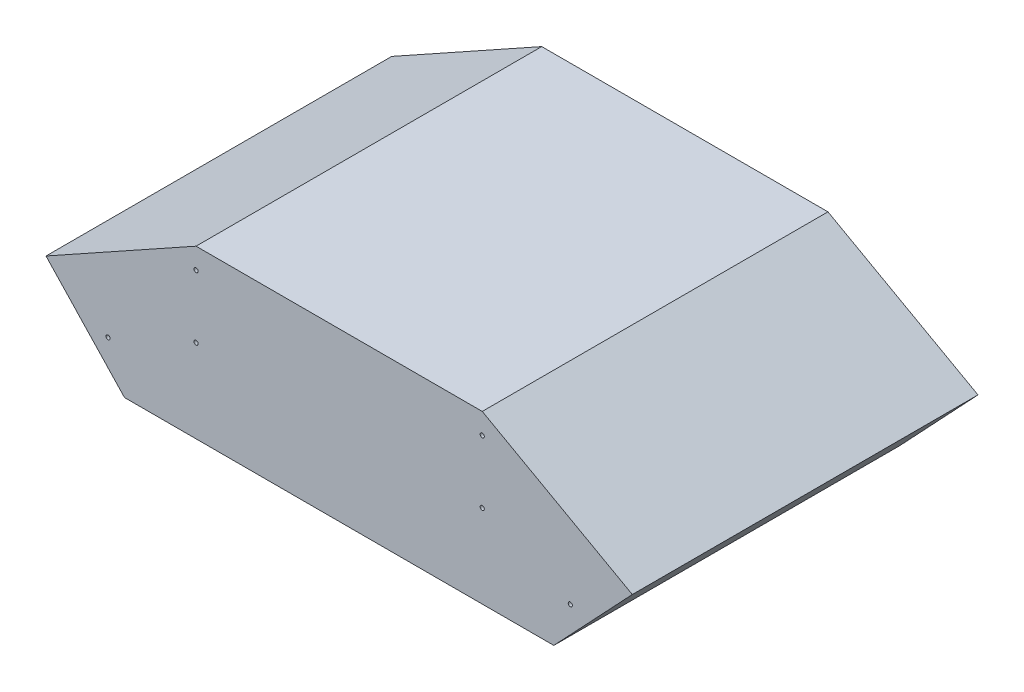
ISO-10303-21;
HEADER;
FILE_DESCRIPTION(('STEP AP214'),'2;1');
FILE_NAME('part.step','',(''),(''),'','','');
FILE_SCHEMA(('AUTOMOTIVE_DESIGN { 1 0 10303 214 1 1 1 1 }'));
ENDSEC;
DATA;
#1=APPLICATION_CONTEXT('core data for automotive mechanical design processes');
#2=APPLICATION_PROTOCOL_DEFINITION('international standard','automotive_design',2000,#1);
#3=PRODUCT_CONTEXT('',#1,'mechanical');
#4=PRODUCT('Part','Part','',(#3));
#5=PRODUCT_RELATED_PRODUCT_CATEGORY('part','',(#4));
#6=PRODUCT_DEFINITION_FORMATION('','',#4);
#7=PRODUCT_DEFINITION_CONTEXT('part definition',#1,'design');
#8=PRODUCT_DEFINITION('design','',#6,#7);
#9=PRODUCT_DEFINITION_SHAPE('','',#8);
#10=(LENGTH_UNIT() NAMED_UNIT(*) SI_UNIT(.MILLI.,.METRE.));
#11=(NAMED_UNIT(*) PLANE_ANGLE_UNIT() SI_UNIT($,.RADIAN.));
#12=(NAMED_UNIT(*) SI_UNIT($,.STERADIAN.) SOLID_ANGLE_UNIT());
#13=UNCERTAINTY_MEASURE_WITH_UNIT(LENGTH_MEASURE(1.E-05),#10,'distance_accuracy_value','');
#14=(GEOMETRIC_REPRESENTATION_CONTEXT(3) GLOBAL_UNCERTAINTY_ASSIGNED_CONTEXT((#13)) GLOBAL_UNIT_ASSIGNED_CONTEXT((#10,
#11,#12)) REPRESENTATION_CONTEXT('',''));
#15=CARTESIAN_POINT('',(0.,0.,0.));
#16=DIRECTION('',(0.,0.,1.));
#17=DIRECTION('',(1.,0.,0.));
#18=AXIS2_PLACEMENT_3D('',#15,#16,#17);
#19=CARTESIAN_POINT('',(0.,-24.1355478406086,50.));
#20=DIRECTION('',(0.,1.,0.));
#21=DIRECTION('',(0.,0.,1.));
#22=AXIS2_PLACEMENT_3D('',#19,#20,#21);
#23=PLANE('',#22);
#24=DIRECTION('',(1.,0.,0.));
#25=VECTOR('',#24,1.);
#26=CARTESIAN_POINT('',(0.,-24.1355478406086,0.));
#27=LINE('',#26,#25);
#28=CARTESIAN_POINT('',(-31.0477998896085,-24.1355478406086,0.));
#29=VERTEX_POINT('',#28);
#30=CARTESIAN_POINT('',(31.0477998896085,-24.1355478406086,0.));
#31=VERTEX_POINT('',#30);
#32=EDGE_CURVE('E141',#29,#31,#27,.T.);
#33=ORIENTED_EDGE('',*,*,#32,.T.);
#34=DIRECTION('',(0.,0.,-1.));
#35=VECTOR('',#34,1.);
#36=CARTESIAN_POINT('',(31.0477998896085,-24.1355478406086,50.));
#37=LINE('',#36,#35);
#38=CARTESIAN_POINT('',(31.0477998896085,-24.1355478406086,50.));
#39=VERTEX_POINT('',#38);
#40=EDGE_CURVE('E11',#39,#31,#37,.T.);
#41=ORIENTED_EDGE('',*,*,#40,.F.);
#42=DIRECTION('',(1.,0.,0.));
#43=VECTOR('',#42,1.);
#44=CARTESIAN_POINT('',(0.,-24.1355478406086,50.));
#45=LINE('',#44,#43);
#46=CARTESIAN_POINT('',(-31.0477998896085,-24.1355478406086,50.));
#47=VERTEX_POINT('',#46);
#48=EDGE_CURVE('E252',#47,#39,#45,.T.);
#49=ORIENTED_EDGE('',*,*,#48,.F.);
#50=DIRECTION('',(0.,0.,-1.));
#51=VECTOR('',#50,1.);
#52=CARTESIAN_POINT('',(-31.0477998896085,-24.1355478406086,50.));
#53=LINE('',#52,#51);
#54=EDGE_CURVE('E53',#47,#29,#53,.T.);
#55=ORIENTED_EDGE('',*,*,#54,.T.);
#56=EDGE_LOOP('',(#33,#41,#49,#55));
#57=FACE_BOUND('',#56,.T.);
#58=ADVANCED_FACE('F36',(#57),#23,.F.);
#59=CARTESIAN_POINT('',(28.4996329319788,-26.8411618301041,50.));
#60=DIRECTION('',(-0.727970767134698,0.68560816958181,0.));
#61=DIRECTION('',(-0.68560816958181,-0.727970767134698,0.));
#62=AXIS2_PLACEMENT_3D('',#59,#60,#61);
#63=PLANE('',#62);
#64=DIRECTION('',(0.68560816958181,0.727970767134698,0.));
#65=VECTOR('',#64,1.);
#66=CARTESIAN_POINT('',(28.4996329319788,-26.8411618301041,0.));
#67=LINE('',#66,#65);
#68=CARTESIAN_POINT('',(42.4006680908968,-12.0812046452642,0.));
#69=VERTEX_POINT('',#68);
#70=EDGE_CURVE('E143',#31,#69,#67,.T.);
#71=ORIENTED_EDGE('',*,*,#70,.T.);
#72=DIRECTION('',(0.,0.,-1.));
#73=VECTOR('',#72,1.);
#74=CARTESIAN_POINT('',(42.4006680908968,-12.0812046452642,50.));
#75=LINE('',#74,#73);
#76=CARTESIAN_POINT('',(42.4006680908968,-12.0812046452642,50.));
#77=VERTEX_POINT('',#76);
#78=EDGE_CURVE('E45',#77,#69,#75,.T.);
#79=ORIENTED_EDGE('',*,*,#78,.F.);
#80=DIRECTION('',(0.68560816958181,0.727970767134698,0.));
#81=VECTOR('',#80,1.);
#82=CARTESIAN_POINT('',(28.4996329319788,-26.8411618301041,50.));
#83=LINE('',#82,#81);
#84=EDGE_CURVE('E86',#39,#77,#83,.T.);
#85=ORIENTED_EDGE('',*,*,#84,.F.);
#86=ORIENTED_EDGE('',*,*,#40,.T.);
#87=EDGE_LOOP('',(#71,#79,#85,#86));
#88=FACE_BOUND('',#87,.T.);
#89=ADVANCED_FACE('F176',(#88),#63,.F.);
#90=CARTESIAN_POINT('',(4.8968682362258,8.79651473784486,50.));
#91=DIRECTION('',(0.486395360066549,0.873738836097911,0.));
#92=DIRECTION('',(-0.873738836097911,0.486395360066549,0.));
#93=AXIS2_PLACEMENT_3D('',#90,#91,#92);
#94=PLANE('',#93);
#95=DIRECTION('',(0.873738836097911,-0.486395360066549,0.));
#96=VECTOR('',#95,1.);
#97=CARTESIAN_POINT('',(4.8968682362258,8.79651473784486,0.));
#98=LINE('',#97,#96);
#99=CARTESIAN_POINT('',(20.698533259739,0.,0.));
#100=VERTEX_POINT('',#99);
#101=EDGE_CURVE('E146',#100,#69,#98,.T.);
#102=ORIENTED_EDGE('',*,*,#101,.F.);
#103=DIRECTION('',(0.,0.,-1.));
#104=VECTOR('',#103,1.);
#105=CARTESIAN_POINT('',(20.698533259739,0.,50.));
#106=LINE('',#105,#104);
#107=CARTESIAN_POINT('',(20.698533259739,0.,50.));
#108=VERTEX_POINT('',#107);
#109=EDGE_CURVE('E105',#108,#100,#106,.T.);
#110=ORIENTED_EDGE('',*,*,#109,.F.);
#111=DIRECTION('',(0.873738836097911,-0.486395360066549,0.));
#112=VECTOR('',#111,1.);
#113=CARTESIAN_POINT('',(4.8968682362258,8.79651473784486,50.));
#114=LINE('',#113,#112);
#115=EDGE_CURVE('E117',#108,#77,#114,.T.);
#116=ORIENTED_EDGE('',*,*,#115,.T.);
#117=ORIENTED_EDGE('',*,*,#78,.T.);
#118=EDGE_LOOP('',(#102,#110,#116,#117));
#119=FACE_BOUND('',#118,.T.);
#120=ADVANCED_FACE('F175',(#119),#94,.T.);
#121=CARTESIAN_POINT('',(0.,0.,50.));
#122=DIRECTION('',(0.,1.,0.));
#123=DIRECTION('',(0.,0.,1.));
#124=AXIS2_PLACEMENT_3D('',#121,#122,#123);
#125=PLANE('',#124);
#126=DIRECTION('',(1.,0.,0.));
#127=VECTOR('',#126,1.);
#128=CARTESIAN_POINT('',(0.,0.,0.));
#129=LINE('',#128,#127);
#130=CARTESIAN_POINT('',(-20.698533259739,0.,0.));
#131=VERTEX_POINT('',#130);
#132=EDGE_CURVE('E102',#131,#100,#129,.T.);
#133=ORIENTED_EDGE('',*,*,#132,.F.);
#134=DIRECTION('',(0.,0.,-1.));
#135=VECTOR('',#134,1.);
#136=CARTESIAN_POINT('',(-20.698533259739,0.,50.));
#137=LINE('',#136,#135);
#138=CARTESIAN_POINT('',(-20.698533259739,0.,50.));
#139=VERTEX_POINT('',#138);
#140=EDGE_CURVE('E96',#139,#131,#137,.T.);
#141=ORIENTED_EDGE('',*,*,#140,.F.);
#142=DIRECTION('',(1.,0.,0.));
#143=VECTOR('',#142,1.);
#144=CARTESIAN_POINT('',(0.,0.,50.));
#145=LINE('',#144,#143);
#146=EDGE_CURVE('E100',#139,#108,#145,.T.);
#147=ORIENTED_EDGE('',*,*,#146,.T.);
#148=ORIENTED_EDGE('',*,*,#109,.T.);
#149=EDGE_LOOP('',(#133,#141,#147,#148));
#150=FACE_BOUND('',#149,.T.);
#151=ADVANCED_FACE('F98',(#150),#125,.T.);
#152=CARTESIAN_POINT('',(-4.8968682362258,8.79651473784486,50.));
#153=DIRECTION('',(0.486395360066549,-0.873738836097911,0.));
#154=DIRECTION('',(0.873738836097911,0.486395360066549,0.));
#155=AXIS2_PLACEMENT_3D('',#152,#153,#154);
#156=PLANE('',#155);
#157=DIRECTION('',(-0.873738836097911,-0.486395360066549,0.));
#158=VECTOR('',#157,1.);
#159=CARTESIAN_POINT('',(-4.8968682362258,8.79651473784486,0.));
#160=LINE('',#159,#158);
#161=CARTESIAN_POINT('',(-42.4006680908968,-12.0812046452642,0.));
#162=VERTEX_POINT('',#161);
#163=EDGE_CURVE('E150',#131,#162,#160,.T.);
#164=ORIENTED_EDGE('',*,*,#163,.T.);
#165=DIRECTION('',(0.,0.,-1.));
#166=VECTOR('',#165,1.);
#167=CARTESIAN_POINT('',(-42.4006680908968,-12.0812046452642,50.));
#168=LINE('',#167,#166);
#169=CARTESIAN_POINT('',(-42.4006680908968,-12.0812046452642,50.));
#170=VERTEX_POINT('',#169);
#171=EDGE_CURVE('E74',#170,#162,#168,.T.);
#172=ORIENTED_EDGE('',*,*,#171,.F.);
#173=DIRECTION('',(-0.873738836097911,-0.486395360066549,0.));
#174=VECTOR('',#173,1.);
#175=CARTESIAN_POINT('',(-4.8968682362258,8.79651473784486,50.));
#176=LINE('',#175,#174);
#177=EDGE_CURVE('E107',#139,#170,#176,.T.);
#178=ORIENTED_EDGE('',*,*,#177,.F.);
#179=ORIENTED_EDGE('',*,*,#140,.T.);
#180=EDGE_LOOP('',(#164,#172,#178,#179));
#181=FACE_BOUND('',#180,.T.);
#182=ADVANCED_FACE('F108',(#181),#156,.F.);
#183=CARTESIAN_POINT('',(20.698533259739,-12.0812046452642,50.));
#184=DIRECTION('',(0.,0.,-1.));
#185=DIRECTION('',(-1.,0.,0.));
#186=AXIS2_PLACEMENT_3D('',#183,#184,#185);
#187=CYLINDRICAL_SURFACE('',#186,0.3);
#188=CARTESIAN_POINT('',(20.698533259739,-12.0812046452642,50.));
#189=DIRECTION('',(0.,0.,1.));
#190=DIRECTION('',(1.,0.,0.));
#191=AXIS2_PLACEMENT_3D('',#188,#189,#190);
#192=CIRCLE('',#191,0.3);
#193=CARTESIAN_POINT('',(20.998533259739,-12.0812046452642,50.));
#194=VERTEX_POINT('',#193);
#195=EDGE_CURVE('E132',#194,#194,#192,.F.);
#196=ORIENTED_EDGE('',*,*,#195,.F.);
#197=EDGE_LOOP('',(#196));
#198=FACE_BOUND('',#197,.T.);
#199=CARTESIAN_POINT('',(20.698533259739,-12.0812046452642,0.));
#200=DIRECTION('',(0.,0.,1.));
#201=DIRECTION('',(1.,0.,0.));
#202=AXIS2_PLACEMENT_3D('',#199,#200,#201);
#203=CIRCLE('',#202,0.3);
#204=CARTESIAN_POINT('',(20.998533259739,-12.0812046452642,0.));
#205=VERTEX_POINT('',#204);
#206=EDGE_CURVE('E164',#205,#205,#203,.F.);
#207=ORIENTED_EDGE('',*,*,#206,.T.);
#208=EDGE_LOOP('',(#207));
#209=FACE_BOUND('',#208,.T.);
#210=ADVANCED_FACE('F205',(#198,#209),#187,.F.);
#211=CARTESIAN_POINT('',(20.698533259739,-3.,50.));
#212=DIRECTION('',(0.,0.,-1.));
#213=DIRECTION('',(-1.,0.,0.));
#214=AXIS2_PLACEMENT_3D('',#211,#212,#213);
#215=CYLINDRICAL_SURFACE('',#214,0.3);
#216=CARTESIAN_POINT('',(20.698533259739,-3.,50.));
#217=DIRECTION('',(0.,0.,1.));
#218=DIRECTION('',(1.,0.,0.));
#219=AXIS2_PLACEMENT_3D('',#216,#217,#218);
#220=CIRCLE('',#219,0.3);
#221=CARTESIAN_POINT('',(20.998533259739,-3.,50.));
#222=VERTEX_POINT('',#221);
#223=EDGE_CURVE('E129',#222,#222,#220,.F.);
#224=ORIENTED_EDGE('',*,*,#223,.F.);
#225=EDGE_LOOP('',(#224));
#226=FACE_BOUND('',#225,.T.);
#227=CARTESIAN_POINT('',(20.698533259739,-3.,0.));
#228=DIRECTION('',(0.,0.,1.));
#229=DIRECTION('',(1.,0.,0.));
#230=AXIS2_PLACEMENT_3D('',#227,#228,#229);
#231=CIRCLE('',#230,0.3);
#232=CARTESIAN_POINT('',(20.998533259739,-3.,0.));
#233=VERTEX_POINT('',#232);
#234=EDGE_CURVE('E161',#233,#233,#231,.F.);
#235=ORIENTED_EDGE('',*,*,#234,.T.);
#236=EDGE_LOOP('',(#235));
#237=FACE_BOUND('',#236,.T.);
#238=ADVANCED_FACE('F209',(#226,#237),#215,.F.);
#239=CARTESIAN_POINT('',(-33.4316980100597,-17.7969016080526,50.));
#240=DIRECTION('',(0.,0.,-1.));
#241=DIRECTION('',(-1.,0.,0.));
#242=AXIS2_PLACEMENT_3D('',#239,#240,#241);
#243=CYLINDRICAL_SURFACE('',#242,0.300000000000004);
#244=CARTESIAN_POINT('',(-33.4316980100597,-17.7969016080526,50.));
#245=DIRECTION('',(0.,0.,1.));
#246=DIRECTION('',(1.,0.,0.));
#247=AXIS2_PLACEMENT_3D('',#244,#245,#246);
#248=CIRCLE('',#247,0.300000000000004);
#249=CARTESIAN_POINT('',(-33.1316980100597,-17.7969016080526,50.));
#250=VERTEX_POINT('',#249);
#251=EDGE_CURVE('E126',#250,#250,#248,.T.);
#252=ORIENTED_EDGE('',*,*,#251,.T.);
#253=EDGE_LOOP('',(#252));
#254=FACE_BOUND('',#253,.T.);
#255=CARTESIAN_POINT('',(-33.4316980100597,-17.7969016080526,0.));
#256=DIRECTION('',(0.,0.,1.));
#257=DIRECTION('',(1.,0.,0.));
#258=AXIS2_PLACEMENT_3D('',#255,#256,#257);
#259=CIRCLE('',#258,0.300000000000004);
#260=CARTESIAN_POINT('',(-33.1316980100597,-17.7969016080526,0.));
#261=VERTEX_POINT('',#260);
#262=EDGE_CURVE('E158',#261,#261,#259,.T.);
#263=ORIENTED_EDGE('',*,*,#262,.F.);
#264=EDGE_LOOP('',(#263));
#265=FACE_BOUND('',#264,.T.);
#266=ADVANCED_FACE('F191',(#254,#265),#243,.F.);
#267=CARTESIAN_POINT('',(-20.698533259739,-12.0812046452642,50.));
#268=DIRECTION('',(0.,0.,-1.));
#269=DIRECTION('',(-1.,0.,0.));
#270=AXIS2_PLACEMENT_3D('',#267,#268,#269);
#271=CYLINDRICAL_SURFACE('',#270,0.3);
#272=CARTESIAN_POINT('',(-20.698533259739,-12.0812046452642,50.));
#273=DIRECTION('',(0.,0.,1.));
#274=DIRECTION('',(1.,0.,0.));
#275=AXIS2_PLACEMENT_3D('',#272,#273,#274);
#276=CIRCLE('',#275,0.3);
#277=CARTESIAN_POINT('',(-20.398533259739,-12.0812046452642,50.));
#278=VERTEX_POINT('',#277);
#279=EDGE_CURVE('E123',#278,#278,#276,.T.);
#280=ORIENTED_EDGE('',*,*,#279,.T.);
#281=EDGE_LOOP('',(#280));
#282=FACE_BOUND('',#281,.T.);
#283=CARTESIAN_POINT('',(-20.698533259739,-12.0812046452642,0.));
#284=DIRECTION('',(0.,0.,1.));
#285=DIRECTION('',(1.,0.,0.));
#286=AXIS2_PLACEMENT_3D('',#283,#284,#285);
#287=CIRCLE('',#286,0.3);
#288=CARTESIAN_POINT('',(-20.398533259739,-12.0812046452642,0.));
#289=VERTEX_POINT('',#288);
#290=EDGE_CURVE('E155',#289,#289,#287,.T.);
#291=ORIENTED_EDGE('',*,*,#290,.F.);
#292=EDGE_LOOP('',(#291));
#293=FACE_BOUND('',#292,.T.);
#294=ADVANCED_FACE('F183',(#282,#293),#271,.F.);
#295=CARTESIAN_POINT('',(-28.4996329319788,-26.8411618301041,50.));
#296=DIRECTION('',(-0.727970767134698,-0.68560816958181,0.));
#297=DIRECTION('',(0.68560816958181,-0.727970767134698,0.));
#298=AXIS2_PLACEMENT_3D('',#295,#296,#297);
#299=PLANE('',#298);
#300=DIRECTION('',(-0.68560816958181,0.727970767134698,0.));
#301=VECTOR('',#300,1.);
#302=CARTESIAN_POINT('',(-28.4996329319788,-26.8411618301041,0.));
#303=LINE('',#302,#301);
#304=EDGE_CURVE('E152',#29,#162,#303,.T.);
#305=ORIENTED_EDGE('',*,*,#304,.F.);
#306=ORIENTED_EDGE('',*,*,#54,.F.);
#307=DIRECTION('',(-0.68560816958181,0.727970767134698,0.));
#308=VECTOR('',#307,1.);
#309=CARTESIAN_POINT('',(-28.4996329319788,-26.8411618301041,50.));
#310=LINE('',#309,#308);
#311=EDGE_CURVE('E111',#47,#170,#310,.T.);
#312=ORIENTED_EDGE('',*,*,#311,.T.);
#313=ORIENTED_EDGE('',*,*,#171,.T.);
#314=EDGE_LOOP('',(#305,#306,#312,#313));
#315=FACE_BOUND('',#314,.T.);
#316=ADVANCED_FACE('F181',(#315),#299,.T.);
#317=CARTESIAN_POINT('',(-20.698533259739,-3.,50.));
#318=DIRECTION('',(0.,0.,-1.));
#319=DIRECTION('',(-1.,0.,0.));
#320=AXIS2_PLACEMENT_3D('',#317,#318,#319);
#321=CYLINDRICAL_SURFACE('',#320,0.3);
#322=CARTESIAN_POINT('',(-20.698533259739,-3.,50.));
#323=DIRECTION('',(0.,0.,1.));
#324=DIRECTION('',(1.,0.,0.));
#325=AXIS2_PLACEMENT_3D('',#322,#323,#324);
#326=CIRCLE('',#325,0.3);
#327=CARTESIAN_POINT('',(-20.398533259739,-3.,50.));
#328=VERTEX_POINT('',#327);
#329=EDGE_CURVE('E170',#328,#328,#326,.T.);
#330=ORIENTED_EDGE('',*,*,#329,.T.);
#331=EDGE_LOOP('',(#330));
#332=FACE_BOUND('',#331,.T.);
#333=CARTESIAN_POINT('',(-20.698533259739,-3.,0.));
#334=DIRECTION('',(0.,0.,1.));
#335=DIRECTION('',(1.,0.,0.));
#336=AXIS2_PLACEMENT_3D('',#333,#334,#335);
#337=CIRCLE('',#336,0.3);
#338=CARTESIAN_POINT('',(-20.398533259739,-3.,0.));
#339=VERTEX_POINT('',#338);
#340=EDGE_CURVE('E138',#339,#339,#337,.T.);
#341=ORIENTED_EDGE('',*,*,#340,.F.);
#342=EDGE_LOOP('',(#341));
#343=FACE_BOUND('',#342,.T.);
#344=ADVANCED_FACE('F38',(#332,#343),#321,.F.);
#345=CARTESIAN_POINT('',(33.4316980100597,-17.7969016080526,50.));
#346=DIRECTION('',(0.,0.,-1.));
#347=DIRECTION('',(-1.,0.,0.));
#348=AXIS2_PLACEMENT_3D('',#345,#346,#347);
#349=CYLINDRICAL_SURFACE('',#348,0.300000000000004);
#350=CARTESIAN_POINT('',(33.4316980100597,-17.7969016080526,50.));
#351=DIRECTION('',(0.,0.,1.));
#352=DIRECTION('',(1.,0.,0.));
#353=AXIS2_PLACEMENT_3D('',#350,#351,#352);
#354=CIRCLE('',#353,0.300000000000004);
#355=CARTESIAN_POINT('',(33.7316980100597,-17.7969016080526,50.));
#356=VERTEX_POINT('',#355);
#357=EDGE_CURVE('E135',#356,#356,#354,.F.);
#358=ORIENTED_EDGE('',*,*,#357,.F.);
#359=EDGE_LOOP('',(#358));
#360=FACE_BOUND('',#359,.T.);
#361=CARTESIAN_POINT('',(33.4316980100597,-17.7969016080526,0.));
#362=DIRECTION('',(0.,0.,1.));
#363=DIRECTION('',(1.,0.,0.));
#364=AXIS2_PLACEMENT_3D('',#361,#362,#363);
#365=CIRCLE('',#364,0.300000000000004);
#366=CARTESIAN_POINT('',(33.7316980100597,-17.7969016080526,0.));
#367=VERTEX_POINT('',#366);
#368=EDGE_CURVE('E167',#367,#367,#365,.F.);
#369=ORIENTED_EDGE('',*,*,#368,.T.);
#370=EDGE_LOOP('',(#369));
#371=FACE_BOUND('',#370,.T.);
#372=ADVANCED_FACE('F189',(#360,#371),#349,.F.);
#373=CARTESIAN_POINT('',(0.,0.,50.));
#374=DIRECTION('',(0.,0.,1.));
#375=DIRECTION('',(1.,0.,0.));
#376=AXIS2_PLACEMENT_3D('',#373,#374,#375);
#377=PLANE('',#376);
#378=ORIENTED_EDGE('',*,*,#329,.F.);
#379=EDGE_LOOP('',(#378));
#380=FACE_BOUND('',#379,.T.);
#381=ORIENTED_EDGE('',*,*,#48,.T.);
#382=ORIENTED_EDGE('',*,*,#84,.T.);
#383=ORIENTED_EDGE('',*,*,#115,.F.);
#384=ORIENTED_EDGE('',*,*,#146,.F.);
#385=ORIENTED_EDGE('',*,*,#177,.T.);
#386=ORIENTED_EDGE('',*,*,#311,.F.);
#387=EDGE_LOOP('',(#381,#382,#383,#384,#385,#386));
#388=FACE_BOUND('',#387,.T.);
#389=ORIENTED_EDGE('',*,*,#279,.F.);
#390=EDGE_LOOP('',(#389));
#391=FACE_BOUND('',#390,.T.);
#392=ORIENTED_EDGE('',*,*,#251,.F.);
#393=EDGE_LOOP('',(#392));
#394=FACE_BOUND('',#393,.T.);
#395=ORIENTED_EDGE('',*,*,#223,.T.);
#396=EDGE_LOOP('',(#395));
#397=FACE_BOUND('',#396,.T.);
#398=ORIENTED_EDGE('',*,*,#195,.T.);
#399=EDGE_LOOP('',(#398));
#400=FACE_BOUND('',#399,.T.);
#401=ORIENTED_EDGE('',*,*,#357,.T.);
#402=EDGE_LOOP('',(#401));
#403=FACE_BOUND('',#402,.T.);
#404=ADVANCED_FACE('F114',(#380,#388,#391,#394,#397,#400,#403),#377,.T.);
#405=CARTESIAN_POINT('',(0.,0.,0.));
#406=DIRECTION('',(0.,0.,1.));
#407=DIRECTION('',(1.,0.,0.));
#408=AXIS2_PLACEMENT_3D('',#405,#406,#407);
#409=PLANE('',#408);
#410=ORIENTED_EDGE('',*,*,#340,.T.);
#411=EDGE_LOOP('',(#410));
#412=FACE_BOUND('',#411,.T.);
#413=ORIENTED_EDGE('',*,*,#32,.F.);
#414=ORIENTED_EDGE('',*,*,#304,.T.);
#415=ORIENTED_EDGE('',*,*,#163,.F.);
#416=ORIENTED_EDGE('',*,*,#132,.T.);
#417=ORIENTED_EDGE('',*,*,#101,.T.);
#418=ORIENTED_EDGE('',*,*,#70,.F.);
#419=EDGE_LOOP('',(#413,#414,#415,#416,#417,#418));
#420=FACE_BOUND('',#419,.T.);
#421=ORIENTED_EDGE('',*,*,#290,.T.);
#422=EDGE_LOOP('',(#421));
#423=FACE_BOUND('',#422,.T.);
#424=ORIENTED_EDGE('',*,*,#262,.T.);
#425=EDGE_LOOP('',(#424));
#426=FACE_BOUND('',#425,.T.);
#427=ORIENTED_EDGE('',*,*,#234,.F.);
#428=EDGE_LOOP('',(#427));
#429=FACE_BOUND('',#428,.T.);
#430=ORIENTED_EDGE('',*,*,#206,.F.);
#431=EDGE_LOOP('',(#430));
#432=FACE_BOUND('',#431,.T.);
#433=ORIENTED_EDGE('',*,*,#368,.F.);
#434=EDGE_LOOP('',(#433));
#435=FACE_BOUND('',#434,.T.);
#436=ADVANCED_FACE('F179',(#412,#420,#423,#426,#429,#432,#435),#409,.F.);
#437=CLOSED_SHELL('',(#58,#89,#120,#151,#182,#210,#238,#266,#294,#316,#344,#372,#404,#436));
#438=MANIFOLD_SOLID_BREP('B2',#437);
#439=ADVANCED_BREP_SHAPE_REPRESENTATION('',(#18,#438),#14);
#440=SHAPE_DEFINITION_REPRESENTATION(#9,#439);
ENDSEC;
END-ISO-10303-21;
